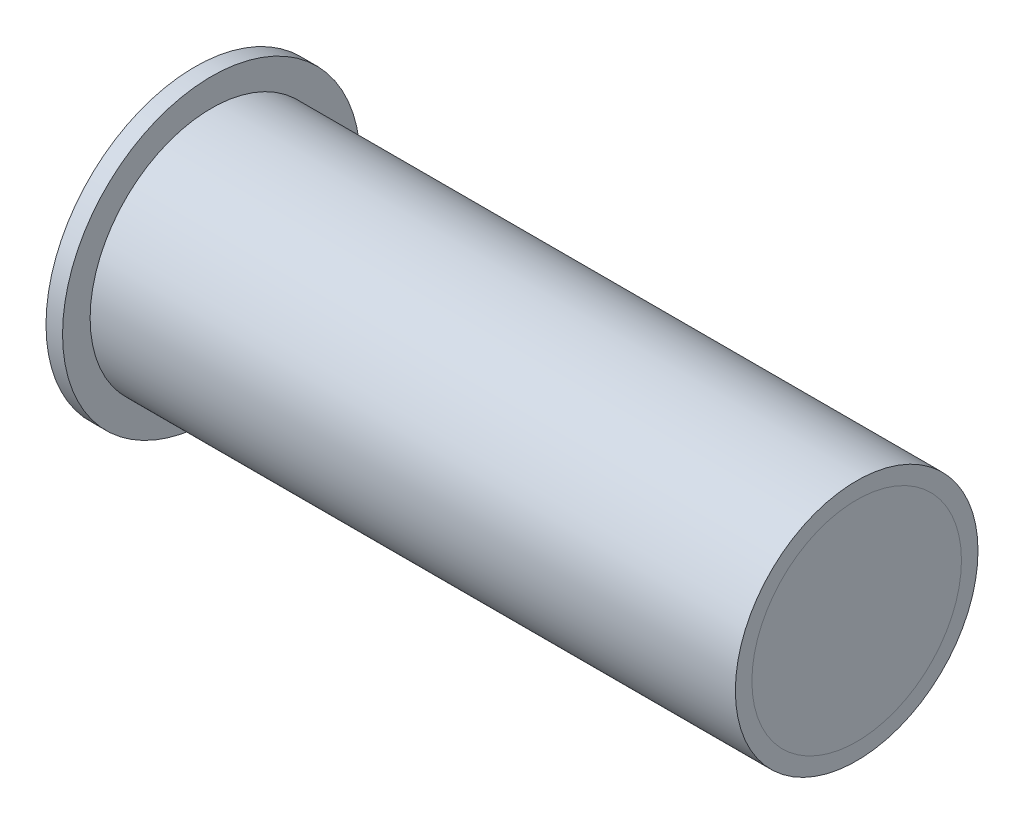
ISO-10303-21;
HEADER;
FILE_DESCRIPTION(('STEP AP214'),'2;1');
FILE_NAME('part.step','',(''),(''),'','','');
FILE_SCHEMA(('AUTOMOTIVE_DESIGN { 1 0 10303 214 1 1 1 1 }'));
ENDSEC;
DATA;
#1=APPLICATION_CONTEXT('core data for automotive mechanical design processes');
#2=APPLICATION_PROTOCOL_DEFINITION('international standard','automotive_design',2000,#1);
#3=PRODUCT_CONTEXT('',#1,'mechanical');
#4=PRODUCT('Part','Part','',(#3));
#5=PRODUCT_RELATED_PRODUCT_CATEGORY('part','',(#4));
#6=PRODUCT_DEFINITION_FORMATION('','',#4);
#7=PRODUCT_DEFINITION_CONTEXT('part definition',#1,'design');
#8=PRODUCT_DEFINITION('design','',#6,#7);
#9=PRODUCT_DEFINITION_SHAPE('','',#8);
#10=(LENGTH_UNIT() NAMED_UNIT(*) SI_UNIT(.MILLI.,.METRE.));
#11=(NAMED_UNIT(*) PLANE_ANGLE_UNIT() SI_UNIT($,.RADIAN.));
#12=(NAMED_UNIT(*) SI_UNIT($,.STERADIAN.) SOLID_ANGLE_UNIT());
#13=UNCERTAINTY_MEASURE_WITH_UNIT(LENGTH_MEASURE(1.E-05),#10,'distance_accuracy_value','');
#14=(GEOMETRIC_REPRESENTATION_CONTEXT(3) GLOBAL_UNCERTAINTY_ASSIGNED_CONTEXT((#13)) GLOBAL_UNIT_ASSIGNED_CONTEXT((#10,
#11,#12)) REPRESENTATION_CONTEXT('',''));
#15=CARTESIAN_POINT('',(0.,0.,0.));
#16=DIRECTION('',(0.,0.,1.));
#17=DIRECTION('',(1.,0.,0.));
#18=AXIS2_PLACEMENT_3D('',#15,#16,#17);
#19=CARTESIAN_POINT('',(320.969675214473,0.,0.));
#20=DIRECTION('',(1.,0.,0.));
#21=DIRECTION('',(0.,0.,-1.));
#22=AXIS2_PLACEMENT_3D('',#19,#20,#21);
#23=CYLINDRICAL_SURFACE('',#22,19.);
#24=CARTESIAN_POINT('',(320.969675214473,0.,0.));
#25=DIRECTION('',(1.,0.,0.));
#26=DIRECTION('',(0.,0.,-1.));
#27=AXIS2_PLACEMENT_3D('',#24,#25,#26);
#28=CIRCLE('',#27,19.);
#29=CARTESIAN_POINT('',(320.969675214473,0.,-19.));
#30=VERTEX_POINT('',#29);
#31=EDGE_CURVE('E11',#30,#30,#28,.T.);
#32=ORIENTED_EDGE('',*,*,#31,.T.);
#33=EDGE_LOOP('',(#32));
#34=FACE_BOUND('',#33,.T.);
#35=CARTESIAN_POINT('',(323.969675214473,0.,0.));
#36=DIRECTION('',(1.,0.,0.));
#37=DIRECTION('',(0.,0.,-1.));
#38=AXIS2_PLACEMENT_3D('',#35,#36,#37);
#39=CIRCLE('',#38,19.);
#40=CARTESIAN_POINT('',(323.969675214473,0.,-19.));
#41=VERTEX_POINT('',#40);
#42=EDGE_CURVE('E44',#41,#41,#39,.T.);
#43=ORIENTED_EDGE('',*,*,#42,.F.);
#44=EDGE_LOOP('',(#43));
#45=FACE_BOUND('',#44,.T.);
#46=ADVANCED_FACE('F41',(#34,#45),#23,.T.);
#47=CARTESIAN_POINT('',(320.969675214473,0.,0.));
#48=DIRECTION('',(1.,0.,0.));
#49=DIRECTION('',(0.,0.,-1.));
#50=AXIS2_PLACEMENT_3D('',#47,#48,#49);
#51=PLANE('',#50);
#52=ORIENTED_EDGE('',*,*,#31,.F.);
#53=EDGE_LOOP('',(#52));
#54=FACE_BOUND('',#53,.T.);
#55=ADVANCED_FACE('F56',(#54),#51,.F.);
#56=CARTESIAN_POINT('',(323.969675214473,0.,0.));
#57=DIRECTION('',(1.,0.,0.));
#58=DIRECTION('',(0.,0.,-1.));
#59=AXIS2_PLACEMENT_3D('',#56,#57,#58);
#60=PLANE('',#59);
#61=ORIENTED_EDGE('',*,*,#42,.T.);
#62=EDGE_LOOP('',(#61));
#63=FACE_BOUND('',#62,.T.);
#64=ADVANCED_FACE('F53',(#63),#60,.T.);
#65=CLOSED_SHELL('',(#46,#55,#64));
#66=MANIFOLD_SOLID_BREP('B2',#65);
#67=CARTESIAN_POINT('',(206.969675214473,0.,0.));
#68=DIRECTION('',(-1.,0.,0.));
#69=DIRECTION('',(0.,0.,1.));
#70=AXIS2_PLACEMENT_3D('',#67,#68,#69);
#71=CYLINDRICAL_SURFACE('',#70,19.);
#72=CARTESIAN_POINT('',(206.969675214473,0.,0.));
#73=DIRECTION('',(-1.,0.,0.));
#74=DIRECTION('',(0.,0.,1.));
#75=AXIS2_PLACEMENT_3D('',#72,#73,#74);
#76=CIRCLE('',#75,19.);
#77=CARTESIAN_POINT('',(206.969675214473,0.,19.));
#78=VERTEX_POINT('',#77);
#79=EDGE_CURVE('E40',#78,#78,#76,.T.);
#80=ORIENTED_EDGE('',*,*,#79,.T.);
#81=EDGE_LOOP('',(#80));
#82=FACE_BOUND('',#81,.T.);
#83=CARTESIAN_POINT('',(203.969675214473,0.,0.));
#84=DIRECTION('',(-1.,0.,0.));
#85=DIRECTION('',(0.,0.,1.));
#86=AXIS2_PLACEMENT_3D('',#83,#84,#85);
#87=CIRCLE('',#86,19.);
#88=CARTESIAN_POINT('',(203.969675214473,0.,19.));
#89=VERTEX_POINT('',#88);
#90=EDGE_CURVE('E91',#89,#89,#87,.T.);
#91=ORIENTED_EDGE('',*,*,#90,.F.);
#92=EDGE_LOOP('',(#91));
#93=FACE_BOUND('',#92,.T.);
#94=ADVANCED_FACE('F88',(#82,#93),#71,.T.);
#95=CARTESIAN_POINT('',(206.969675214473,0.,0.));
#96=DIRECTION('',(-1.,0.,0.));
#97=DIRECTION('',(0.,0.,1.));
#98=AXIS2_PLACEMENT_3D('',#95,#96,#97);
#99=PLANE('',#98);
#100=ORIENTED_EDGE('',*,*,#79,.F.);
#101=EDGE_LOOP('',(#100));
#102=FACE_BOUND('',#101,.T.);
#103=ADVANCED_FACE('F103',(#102),#99,.F.);
#104=CARTESIAN_POINT('',(203.969675214473,0.,0.));
#105=DIRECTION('',(-1.,0.,0.));
#106=DIRECTION('',(0.,0.,1.));
#107=AXIS2_PLACEMENT_3D('',#104,#105,#106);
#108=PLANE('',#107);
#109=ORIENTED_EDGE('',*,*,#90,.T.);
#110=EDGE_LOOP('',(#109));
#111=FACE_BOUND('',#110,.T.);
#112=ADVANCED_FACE('F100',(#111),#108,.T.);
#113=CLOSED_SHELL('',(#94,#103,#112));
#114=MANIFOLD_SOLID_BREP('B6',#113);
#115=CARTESIAN_POINT('',(194.,0.,0.));
#116=DIRECTION('',(-1.,0.,0.));
#117=DIRECTION('',(0.,0.,1.));
#118=AXIS2_PLACEMENT_3D('',#115,#116,#117);
#119=CYLINDRICAL_SURFACE('',#118,19.);
#120=CARTESIAN_POINT('',(323.969675214473,0.,0.));
#121=DIRECTION('',(-1.,0.,0.));
#122=DIRECTION('',(0.,0.,1.));
#123=AXIS2_PLACEMENT_3D('',#120,#121,#122);
#124=CIRCLE('',#123,19.);
#125=CARTESIAN_POINT('',(323.969675214473,0.,19.));
#126=VERTEX_POINT('',#125);
#127=EDGE_CURVE('E150',#126,#126,#124,.T.);
#128=ORIENTED_EDGE('',*,*,#127,.F.);
#129=EDGE_LOOP('',(#128));
#130=FACE_BOUND('',#129,.T.);
#131=CARTESIAN_POINT('',(203.969675214473,0.,0.));
#132=DIRECTION('',(-1.,0.,0.));
#133=DIRECTION('',(0.,0.,1.));
#134=AXIS2_PLACEMENT_3D('',#131,#132,#133);
#135=CIRCLE('',#134,19.);
#136=CARTESIAN_POINT('',(203.969675214473,0.,19.));
#137=VERTEX_POINT('',#136);
#138=EDGE_CURVE('E87',#137,#137,#135,.T.);
#139=ORIENTED_EDGE('',*,*,#138,.T.);
#140=EDGE_LOOP('',(#139));
#141=FACE_BOUND('',#140,.T.);
#142=ADVANCED_FACE('F128',(#130,#141),#119,.F.);
#143=CARTESIAN_POINT('',(203.969675214473,27.,0.));
#144=DIRECTION('',(1.,0.,0.));
#145=DIRECTION('',(0.,0.,-1.));
#146=AXIS2_PLACEMENT_3D('',#143,#144,#145);
#147=PLANE('',#146);
#148=ORIENTED_EDGE('',*,*,#138,.F.);
#149=EDGE_LOOP('',(#148));
#150=FACE_BOUND('',#149,.T.);
#151=CARTESIAN_POINT('',(203.969675214473,0.,0.));
#152=DIRECTION('',(-1.,0.,0.));
#153=DIRECTION('',(0.,0.,1.));
#154=AXIS2_PLACEMENT_3D('',#151,#152,#153);
#155=CIRCLE('',#154,27.);
#156=CARTESIAN_POINT('',(203.969675214473,0.,27.));
#157=VERTEX_POINT('',#156);
#158=EDGE_CURVE('E134',#157,#157,#155,.T.);
#159=ORIENTED_EDGE('',*,*,#158,.T.);
#160=EDGE_LOOP('',(#159));
#161=FACE_BOUND('',#160,.T.);
#162=ADVANCED_FACE('F158',(#150,#161),#147,.F.);
#163=CARTESIAN_POINT('',(194.,0.,0.));
#164=DIRECTION('',(-1.,0.,0.));
#165=DIRECTION('',(0.,0.,1.));
#166=AXIS2_PLACEMENT_3D('',#163,#164,#165);
#167=CYLINDRICAL_SURFACE('',#166,27.);
#168=CARTESIAN_POINT('',(206.969675214473,0.,0.));
#169=DIRECTION('',(-1.,0.,0.));
#170=DIRECTION('',(0.,0.,1.));
#171=AXIS2_PLACEMENT_3D('',#168,#169,#170);
#172=CIRCLE('',#171,27.);
#173=CARTESIAN_POINT('',(206.969675214473,0.,27.));
#174=VERTEX_POINT('',#173);
#175=EDGE_CURVE('E138',#174,#174,#172,.T.);
#176=ORIENTED_EDGE('',*,*,#175,.T.);
#177=EDGE_LOOP('',(#176));
#178=FACE_BOUND('',#177,.T.);
#179=ORIENTED_EDGE('',*,*,#158,.F.);
#180=EDGE_LOOP('',(#179));
#181=FACE_BOUND('',#180,.T.);
#182=ADVANCED_FACE('F162',(#178,#181),#167,.T.);
#183=CARTESIAN_POINT('',(206.969675214473,27.,0.));
#184=DIRECTION('',(1.,0.,0.));
#185=DIRECTION('',(0.,0.,-1.));
#186=AXIS2_PLACEMENT_3D('',#183,#184,#185);
#187=PLANE('',#186);
#188=CARTESIAN_POINT('',(206.969675214473,0.,0.));
#189=DIRECTION('',(-1.,0.,0.));
#190=DIRECTION('',(0.,0.,1.));
#191=AXIS2_PLACEMENT_3D('',#188,#189,#190);
#192=CIRCLE('',#191,22.);
#193=CARTESIAN_POINT('',(206.969675214473,0.,22.));
#194=VERTEX_POINT('',#193);
#195=EDGE_CURVE('E142',#194,#194,#192,.T.);
#196=ORIENTED_EDGE('',*,*,#195,.T.);
#197=EDGE_LOOP('',(#196));
#198=FACE_BOUND('',#197,.T.);
#199=ORIENTED_EDGE('',*,*,#175,.F.);
#200=EDGE_LOOP('',(#199));
#201=FACE_BOUND('',#200,.T.);
#202=ADVANCED_FACE('F167',(#198,#201),#187,.T.);
#203=CARTESIAN_POINT('',(194.,0.,0.));
#204=DIRECTION('',(-1.,0.,0.));
#205=DIRECTION('',(0.,0.,1.));
#206=AXIS2_PLACEMENT_3D('',#203,#204,#205);
#207=CYLINDRICAL_SURFACE('',#206,22.);
#208=CARTESIAN_POINT('',(323.969675214473,0.,0.));
#209=DIRECTION('',(-1.,0.,0.));
#210=DIRECTION('',(0.,0.,1.));
#211=AXIS2_PLACEMENT_3D('',#208,#209,#210);
#212=CIRCLE('',#211,22.);
#213=CARTESIAN_POINT('',(323.969675214473,0.,22.));
#214=VERTEX_POINT('',#213);
#215=EDGE_CURVE('E147',#214,#214,#212,.T.);
#216=ORIENTED_EDGE('',*,*,#215,.T.);
#217=EDGE_LOOP('',(#216));
#218=FACE_BOUND('',#217,.T.);
#219=ORIENTED_EDGE('',*,*,#195,.F.);
#220=EDGE_LOOP('',(#219));
#221=FACE_BOUND('',#220,.T.);
#222=ADVANCED_FACE('F173',(#218,#221),#207,.T.);
#223=CARTESIAN_POINT('',(323.969675214473,22.,0.));
#224=DIRECTION('',(1.,0.,0.));
#225=DIRECTION('',(0.,0.,-1.));
#226=AXIS2_PLACEMENT_3D('',#223,#224,#225);
#227=PLANE('',#226);
#228=ORIENTED_EDGE('',*,*,#127,.T.);
#229=EDGE_LOOP('',(#228));
#230=FACE_BOUND('',#229,.T.);
#231=ORIENTED_EDGE('',*,*,#215,.F.);
#232=EDGE_LOOP('',(#231));
#233=FACE_BOUND('',#232,.T.);
#234=ADVANCED_FACE('F154',(#230,#233),#227,.T.);
#235=CLOSED_SHELL('',(#142,#162,#182,#202,#222,#234));
#236=MANIFOLD_SOLID_BREP('B35',#235);
#237=ADVANCED_BREP_SHAPE_REPRESENTATION('',(#18,#66,#114,#236),#14);
#238=SHAPE_DEFINITION_REPRESENTATION(#9,#237);
ENDSEC;
END-ISO-10303-21;
